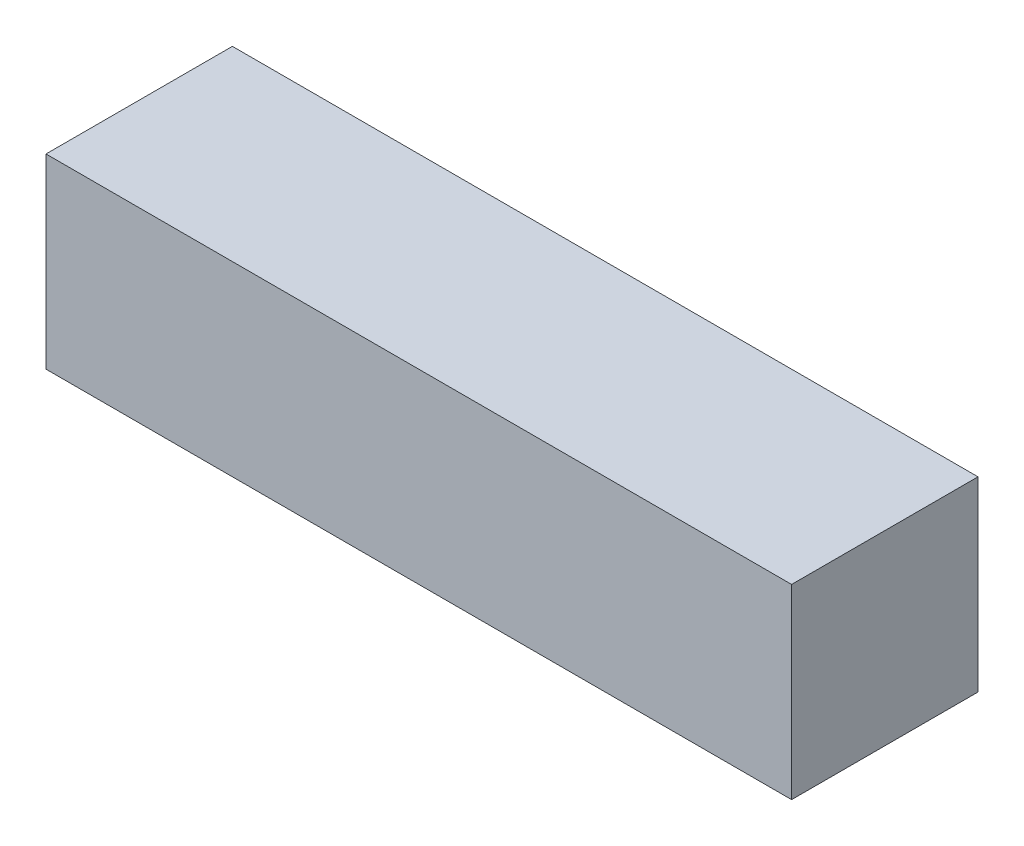
ISO-10303-21;
HEADER;
FILE_DESCRIPTION(('STEP AP214'),'2;1');
FILE_NAME('part.step','',(''),(''),'','','');
FILE_SCHEMA(('AUTOMOTIVE_DESIGN { 1 0 10303 214 1 1 1 1 }'));
ENDSEC;
DATA;
#1=APPLICATION_CONTEXT('core data for automotive mechanical design processes');
#2=APPLICATION_PROTOCOL_DEFINITION('international standard','automotive_design',2000,#1);
#3=PRODUCT_CONTEXT('',#1,'mechanical');
#4=PRODUCT('Part','Part','',(#3));
#5=PRODUCT_RELATED_PRODUCT_CATEGORY('part','',(#4));
#6=PRODUCT_DEFINITION_FORMATION('','',#4);
#7=PRODUCT_DEFINITION_CONTEXT('part definition',#1,'design');
#8=PRODUCT_DEFINITION('design','',#6,#7);
#9=PRODUCT_DEFINITION_SHAPE('','',#8);
#10=(LENGTH_UNIT() NAMED_UNIT(*) SI_UNIT(.MILLI.,.METRE.));
#11=(NAMED_UNIT(*) PLANE_ANGLE_UNIT() SI_UNIT($,.RADIAN.));
#12=(NAMED_UNIT(*) SI_UNIT($,.STERADIAN.) SOLID_ANGLE_UNIT());
#13=UNCERTAINTY_MEASURE_WITH_UNIT(LENGTH_MEASURE(1.E-05),#10,'distance_accuracy_value','');
#14=(GEOMETRIC_REPRESENTATION_CONTEXT(3) GLOBAL_UNCERTAINTY_ASSIGNED_CONTEXT((#13)) GLOBAL_UNIT_ASSIGNED_CONTEXT((#10,
#11,#12)) REPRESENTATION_CONTEXT('',''));
#15=CARTESIAN_POINT('',(0.,0.,0.));
#16=DIRECTION('',(0.,0.,1.));
#17=DIRECTION('',(1.,0.,0.));
#18=AXIS2_PLACEMENT_3D('',#15,#16,#17);
#19=CARTESIAN_POINT('',(-6.35,-3.175,-1.5875));
#20=DIRECTION('',(-1.,0.,0.));
#21=DIRECTION('',(0.,0.,1.));
#22=AXIS2_PLACEMENT_3D('',#19,#20,#21);
#23=PLANE('',#22);
#24=DIRECTION('',(0.,0.,1.));
#25=VECTOR('',#24,1.);
#26=CARTESIAN_POINT('',(-6.35,0.,-1.5875));
#27=LINE('',#26,#25);
#28=CARTESIAN_POINT('',(-6.35,0.,-1.5875));
#29=VERTEX_POINT('',#28);
#30=CARTESIAN_POINT('',(-6.35,0.,1.5875));
#31=VERTEX_POINT('',#30);
#32=EDGE_CURVE('E96',#29,#31,#27,.T.);
#33=ORIENTED_EDGE('',*,*,#32,.F.);
#34=DIRECTION('',(0.,1.,0.));
#35=VECTOR('',#34,1.);
#36=CARTESIAN_POINT('',(-6.35,-3.175,-1.5875));
#37=LINE('',#36,#35);
#38=CARTESIAN_POINT('',(-6.35,-3.175,-1.5875));
#39=VERTEX_POINT('',#38);
#40=EDGE_CURVE('E11',#39,#29,#37,.T.);
#41=ORIENTED_EDGE('',*,*,#40,.F.);
#42=DIRECTION('',(0.,0.,1.));
#43=VECTOR('',#42,1.);
#44=CARTESIAN_POINT('',(-6.35,-3.175,-1.5875));
#45=LINE('',#44,#43);
#46=CARTESIAN_POINT('',(-6.35,-3.175,1.5875));
#47=VERTEX_POINT('',#46);
#48=EDGE_CURVE('E90',#39,#47,#45,.T.);
#49=ORIENTED_EDGE('',*,*,#48,.T.);
#50=DIRECTION('',(0.,1.,0.));
#51=VECTOR('',#50,1.);
#52=CARTESIAN_POINT('',(-6.35,-3.175,1.5875));
#53=LINE('',#52,#51);
#54=EDGE_CURVE('E35',#47,#31,#53,.T.);
#55=ORIENTED_EDGE('',*,*,#54,.T.);
#56=EDGE_LOOP('',(#33,#41,#49,#55));
#57=FACE_BOUND('',#56,.T.);
#58=ADVANCED_FACE('F32',(#57),#23,.T.);
#59=CARTESIAN_POINT('',(-6.35,-3.175,-1.5875));
#60=DIRECTION('',(0.,0.,-1.));
#61=DIRECTION('',(-1.,0.,0.));
#62=AXIS2_PLACEMENT_3D('',#59,#60,#61);
#63=PLANE('',#62);
#64=DIRECTION('',(-1.,0.,0.));
#65=VECTOR('',#64,1.);
#66=CARTESIAN_POINT('',(-6.35,0.,-1.5875));
#67=LINE('',#66,#65);
#68=CARTESIAN_POINT('',(6.35,0.,-1.5875));
#69=VERTEX_POINT('',#68);
#70=EDGE_CURVE('E92',#69,#29,#67,.T.);
#71=ORIENTED_EDGE('',*,*,#70,.F.);
#72=DIRECTION('',(0.,1.,0.));
#73=VECTOR('',#72,1.);
#74=CARTESIAN_POINT('',(6.35,-3.175,-1.5875));
#75=LINE('',#74,#73);
#76=CARTESIAN_POINT('',(6.35,-3.175,-1.5875));
#77=VERTEX_POINT('',#76);
#78=EDGE_CURVE('E41',#77,#69,#75,.T.);
#79=ORIENTED_EDGE('',*,*,#78,.F.);
#80=DIRECTION('',(-1.,0.,0.));
#81=VECTOR('',#80,1.);
#82=CARTESIAN_POINT('',(-6.35,-3.175,-1.5875));
#83=LINE('',#82,#81);
#84=EDGE_CURVE('E87',#77,#39,#83,.T.);
#85=ORIENTED_EDGE('',*,*,#84,.T.);
#86=ORIENTED_EDGE('',*,*,#40,.T.);
#87=EDGE_LOOP('',(#71,#79,#85,#86));
#88=FACE_BOUND('',#87,.T.);
#89=ADVANCED_FACE('F106',(#88),#63,.T.);
#90=CARTESIAN_POINT('',(6.35,-3.175,-1.5875));
#91=DIRECTION('',(1.,0.,0.));
#92=DIRECTION('',(0.,0.,-1.));
#93=AXIS2_PLACEMENT_3D('',#90,#91,#92);
#94=PLANE('',#93);
#95=DIRECTION('',(0.,0.,-1.));
#96=VECTOR('',#95,1.);
#97=CARTESIAN_POINT('',(6.35,0.,-1.5875));
#98=LINE('',#97,#96);
#99=CARTESIAN_POINT('',(6.35,0.,1.5875));
#100=VERTEX_POINT('',#99);
#101=EDGE_CURVE('E82',#100,#69,#98,.T.);
#102=ORIENTED_EDGE('',*,*,#101,.F.);
#103=DIRECTION('',(0.,1.,0.));
#104=VECTOR('',#103,1.);
#105=CARTESIAN_POINT('',(6.35,-3.175,1.5875));
#106=LINE('',#105,#104);
#107=CARTESIAN_POINT('',(6.35,-3.175,1.5875));
#108=VERTEX_POINT('',#107);
#109=EDGE_CURVE('E77',#108,#100,#106,.T.);
#110=ORIENTED_EDGE('',*,*,#109,.F.);
#111=DIRECTION('',(0.,0.,-1.));
#112=VECTOR('',#111,1.);
#113=CARTESIAN_POINT('',(6.35,-3.175,-1.5875));
#114=LINE('',#113,#112);
#115=EDGE_CURVE('E80',#108,#77,#114,.T.);
#116=ORIENTED_EDGE('',*,*,#115,.T.);
#117=ORIENTED_EDGE('',*,*,#78,.T.);
#118=EDGE_LOOP('',(#102,#110,#116,#117));
#119=FACE_BOUND('',#118,.T.);
#120=ADVANCED_FACE('F79',(#119),#94,.T.);
#121=CARTESIAN_POINT('',(-6.35,-3.175,1.5875));
#122=DIRECTION('',(0.,0.,1.));
#123=DIRECTION('',(1.,0.,0.));
#124=AXIS2_PLACEMENT_3D('',#121,#122,#123);
#125=PLANE('',#124);
#126=DIRECTION('',(1.,0.,0.));
#127=VECTOR('',#126,1.);
#128=CARTESIAN_POINT('',(-6.35,0.,1.5875));
#129=LINE('',#128,#127);
#130=EDGE_CURVE('E99',#31,#100,#129,.T.);
#131=ORIENTED_EDGE('',*,*,#130,.F.);
#132=ORIENTED_EDGE('',*,*,#54,.F.);
#133=DIRECTION('',(1.,0.,0.));
#134=VECTOR('',#133,1.);
#135=CARTESIAN_POINT('',(-6.35,-3.175,1.5875));
#136=LINE('',#135,#134);
#137=EDGE_CURVE('E86',#47,#108,#136,.T.);
#138=ORIENTED_EDGE('',*,*,#137,.T.);
#139=ORIENTED_EDGE('',*,*,#109,.T.);
#140=EDGE_LOOP('',(#131,#132,#138,#139));
#141=FACE_BOUND('',#140,.T.);
#142=ADVANCED_FACE('F89',(#141),#125,.T.);
#143=CARTESIAN_POINT('',(-6.35,-3.175,1.5875));
#144=DIRECTION('',(0.,1.,0.));
#145=DIRECTION('',(0.,0.,1.));
#146=AXIS2_PLACEMENT_3D('',#143,#144,#145);
#147=PLANE('',#146);
#148=ORIENTED_EDGE('',*,*,#48,.F.);
#149=ORIENTED_EDGE('',*,*,#84,.F.);
#150=ORIENTED_EDGE('',*,*,#115,.F.);
#151=ORIENTED_EDGE('',*,*,#137,.F.);
#152=EDGE_LOOP('',(#148,#149,#150,#151));
#153=FACE_BOUND('',#152,.T.);
#154=ADVANCED_FACE('F85',(#153),#147,.F.);
#155=CARTESIAN_POINT('',(-6.35,0.,1.5875));
#156=DIRECTION('',(0.,1.,0.));
#157=DIRECTION('',(0.,0.,1.));
#158=AXIS2_PLACEMENT_3D('',#155,#156,#157);
#159=PLANE('',#158);
#160=ORIENTED_EDGE('',*,*,#32,.T.);
#161=ORIENTED_EDGE('',*,*,#130,.T.);
#162=ORIENTED_EDGE('',*,*,#101,.T.);
#163=ORIENTED_EDGE('',*,*,#70,.T.);
#164=EDGE_LOOP('',(#160,#161,#162,#163));
#165=FACE_BOUND('',#164,.T.);
#166=ADVANCED_FACE('F105',(#165),#159,.T.);
#167=CLOSED_SHELL('',(#58,#89,#120,#142,#154,#166));
#168=MANIFOLD_SOLID_BREP('B2',#167);
#169=ADVANCED_BREP_SHAPE_REPRESENTATION('',(#18,#168),#14);
#170=SHAPE_DEFINITION_REPRESENTATION(#9,#169);
ENDSEC;
END-ISO-10303-21;
